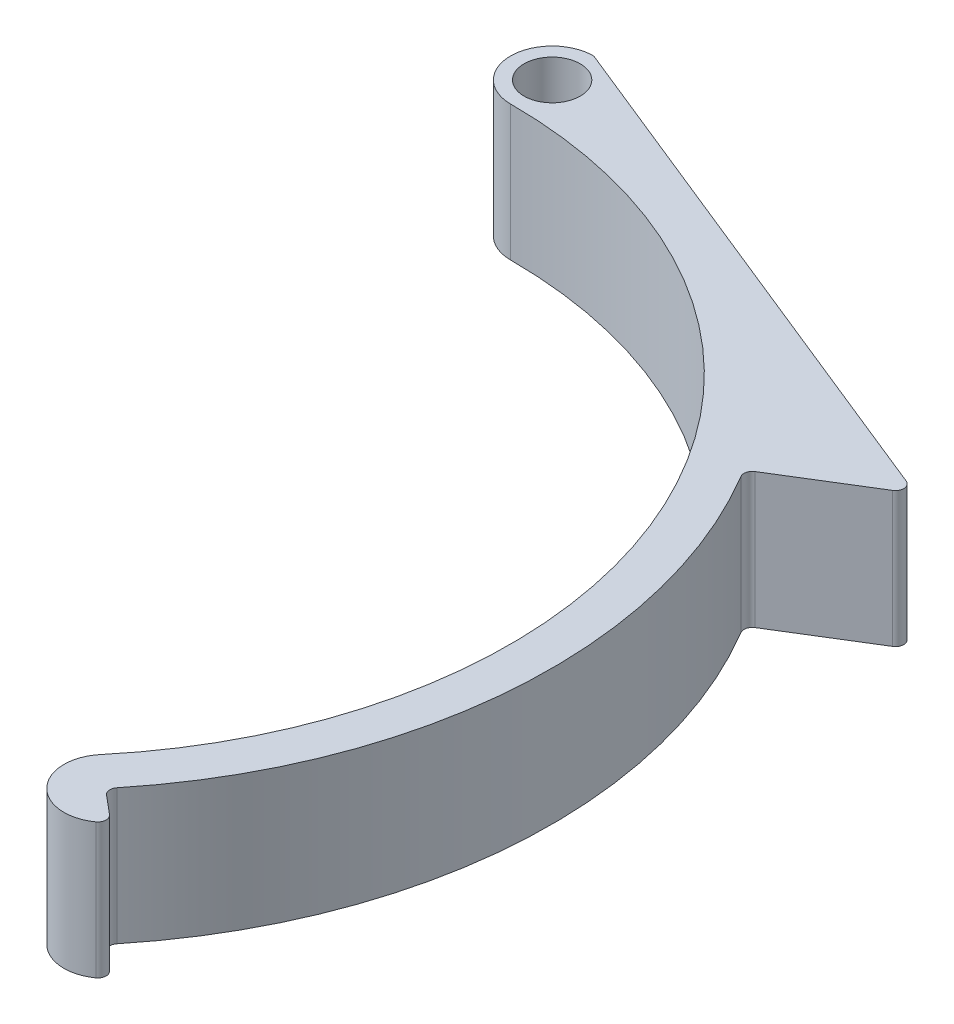
ISO-10303-21;
HEADER;
FILE_DESCRIPTION(('STEP AP214'),'2;1');
FILE_NAME('part.step','',(''),(''),'','','');
FILE_SCHEMA(('AUTOMOTIVE_DESIGN { 1 0 10303 214 1 1 1 1 }'));
ENDSEC;
DATA;
#1=APPLICATION_CONTEXT('core data for automotive mechanical design processes');
#2=APPLICATION_PROTOCOL_DEFINITION('international standard','automotive_design',2000,#1);
#3=PRODUCT_CONTEXT('',#1,'mechanical');
#4=PRODUCT('Part','Part','',(#3));
#5=PRODUCT_RELATED_PRODUCT_CATEGORY('part','',(#4));
#6=PRODUCT_DEFINITION_FORMATION('','',#4);
#7=PRODUCT_DEFINITION_CONTEXT('part definition',#1,'design');
#8=PRODUCT_DEFINITION('design','',#6,#7);
#9=PRODUCT_DEFINITION_SHAPE('','',#8);
#10=(LENGTH_UNIT() NAMED_UNIT(*) SI_UNIT(.MILLI.,.METRE.));
#11=(NAMED_UNIT(*) PLANE_ANGLE_UNIT() SI_UNIT($,.RADIAN.));
#12=(NAMED_UNIT(*) SI_UNIT($,.STERADIAN.) SOLID_ANGLE_UNIT());
#13=UNCERTAINTY_MEASURE_WITH_UNIT(LENGTH_MEASURE(1.E-05),#10,'distance_accuracy_value','');
#14=(GEOMETRIC_REPRESENTATION_CONTEXT(3) GLOBAL_UNCERTAINTY_ASSIGNED_CONTEXT((#13)) GLOBAL_UNIT_ASSIGNED_CONTEXT((#10,
#11,#12)) REPRESENTATION_CONTEXT('',''));
#15=CARTESIAN_POINT('',(0.,0.,0.));
#16=DIRECTION('',(0.,0.,1.));
#17=DIRECTION('',(1.,0.,0.));
#18=AXIS2_PLACEMENT_3D('',#15,#16,#17);
#19=CARTESIAN_POINT('',(18.4107690922549,13.,-45.5602618405853));
#20=DIRECTION('',(0.374663072776281,0.,-0.927161033422908));
#21=DIRECTION('',(-0.927161033422908,0.,-0.374663072776281));
#22=AXIS2_PLACEMENT_3D('',#19,#20,#21);
#23=PLANE('',#22);
#24=DIRECTION('',(0.927161033422908,0.,0.374663072776281));
#25=VECTOR('',#24,1.);
#26=CARTESIAN_POINT('',(18.4107690922549,0.,-45.5602618405853));
#27=LINE('',#26,#25);
#28=CARTESIAN_POINT('',(0.152578115339287,0.,-52.938343628053));
#29=VERTEX_POINT('',#28);
#30=CARTESIAN_POINT('',(50.4547105940548,0.,-32.6113984240491));
#31=VERTEX_POINT('',#30);
#32=EDGE_CURVE('E189',#29,#31,#27,.T.);
#33=ORIENTED_EDGE('',*,*,#32,.F.);
#34=DIRECTION('',(0.,-1.,0.));
#35=VECTOR('',#34,1.);
#36=CARTESIAN_POINT('',(0.152578115339284,13.,-52.938343628053));
#37=LINE('',#36,#35);
#38=CARTESIAN_POINT('',(0.152578115339287,13.,-52.938343628053));
#39=VERTEX_POINT('',#38);
#40=EDGE_CURVE('E231',#29,#39,#37,.F.);
#41=ORIENTED_EDGE('',*,*,#40,.T.);
#42=DIRECTION('',(0.927161033422908,0.,0.374663072776281));
#43=VECTOR('',#42,1.);
#44=CARTESIAN_POINT('',(18.4107690922549,13.,-45.5602618405853));
#45=LINE('',#44,#43);
#46=CARTESIAN_POINT('',(50.4547105940548,13.,-32.6113984240491));
#47=VERTEX_POINT('',#46);
#48=EDGE_CURVE('E165',#39,#47,#45,.T.);
#49=ORIENTED_EDGE('',*,*,#48,.T.);
#50=DIRECTION('',(0.,-1.,0.));
#51=VECTOR('',#50,1.);
#52=CARTESIAN_POINT('',(50.4547105940548,13.,-32.6113984240491));
#53=LINE('',#52,#51);
#54=EDGE_CURVE('E227',#47,#31,#53,.T.);
#55=ORIENTED_EDGE('',*,*,#54,.T.);
#56=EDGE_LOOP('',(#33,#41,#49,#55));
#57=FACE_BOUND('',#56,.T.);
#58=ADVANCED_FACE('F45',(#57),#23,.T.);
#59=CARTESIAN_POINT('',(0.,13.,-49.));
#60=DIRECTION('',(0.,-1.,0.));
#61=DIRECTION('',(0.,0.,-1.));
#62=AXIS2_PLACEMENT_3D('',#59,#60,#61);
#63=CYLINDRICAL_SURFACE('',#62,4.);
#64=CARTESIAN_POINT('',(0.,13.,-49.));
#65=DIRECTION('',(0.,1.,0.));
#66=DIRECTION('',(0.,0.,1.));
#67=AXIS2_PLACEMENT_3D('',#64,#65,#66);
#68=CIRCLE('',#67,4.);
#69=CARTESIAN_POINT('',(0.,13.,-45.));
#70=VERTEX_POINT('',#69);
#71=CARTESIAN_POINT('',(-0.183940428602176,13.,-52.9957685016434));
#72=VERTEX_POINT('',#71);
#73=EDGE_CURVE('E140',#70,#72,#68,.F.);
#74=ORIENTED_EDGE('',*,*,#73,.T.);
#75=DIRECTION('',(0.,-1.,0.));
#76=VECTOR('',#75,1.);
#77=CARTESIAN_POINT('',(-0.183940428602176,13.,-52.9957685016434));
#78=LINE('',#77,#76);
#79=CARTESIAN_POINT('',(-0.183940428602176,0.,-52.9957685016434));
#80=VERTEX_POINT('',#79);
#81=EDGE_CURVE('E148',#72,#80,#78,.T.);
#82=ORIENTED_EDGE('',*,*,#81,.T.);
#83=CARTESIAN_POINT('',(0.,0.,-49.));
#84=DIRECTION('',(0.,1.,0.));
#85=DIRECTION('',(0.,0.,1.));
#86=AXIS2_PLACEMENT_3D('',#83,#84,#85);
#87=CIRCLE('',#86,4.);
#88=CARTESIAN_POINT('',(0.,0.,-45.));
#89=VERTEX_POINT('',#88);
#90=EDGE_CURVE('E143',#89,#80,#87,.F.);
#91=ORIENTED_EDGE('',*,*,#90,.F.);
#92=DIRECTION('',(0.,-1.,0.));
#93=VECTOR('',#92,1.);
#94=CARTESIAN_POINT('',(0.,13.,-45.));
#95=LINE('',#94,#93);
#96=EDGE_CURVE('E135',#70,#89,#95,.T.);
#97=ORIENTED_EDGE('',*,*,#96,.F.);
#98=EDGE_LOOP('',(#74,#82,#91,#97));
#99=FACE_BOUND('',#98,.T.);
#100=ADVANCED_FACE('F137',(#99),#63,.T.);
#101=CARTESIAN_POINT('',(0.,13.,0.));
#102=DIRECTION('',(0.,-1.,0.));
#103=DIRECTION('',(0.,0.,-1.));
#104=AXIS2_PLACEMENT_3D('',#101,#102,#103);
#105=CYLINDRICAL_SURFACE('',#104,45.);
#106=CARTESIAN_POINT('',(0.,0.,0.));
#107=DIRECTION('',(0.,1.,0.));
#108=DIRECTION('',(0.,0.,1.));
#109=AXIS2_PLACEMENT_3D('',#106,#107,#108);
#110=CIRCLE('',#109,45.);
#111=CARTESIAN_POINT('',(34.4719999403541,0.,28.9254424358942));
#112=VERTEX_POINT('',#111);
#113=EDGE_CURVE('E195',#89,#112,#110,.F.);
#114=ORIENTED_EDGE('',*,*,#113,.T.);
#115=DIRECTION('',(0.,-1.,0.));
#116=VECTOR('',#115,1.);
#117=CARTESIAN_POINT('',(34.4719999403541,13.,28.9254424358942));
#118=LINE('',#117,#116);
#119=CARTESIAN_POINT('',(34.4719999403541,13.,28.9254424358942));
#120=VERTEX_POINT('',#119);
#121=EDGE_CURVE('E149',#120,#112,#118,.T.);
#122=ORIENTED_EDGE('',*,*,#121,.F.);
#123=CARTESIAN_POINT('',(0.,13.,0.));
#124=DIRECTION('',(0.,1.,0.));
#125=DIRECTION('',(0.,0.,1.));
#126=AXIS2_PLACEMENT_3D('',#123,#124,#125);
#127=CIRCLE('',#126,45.);
#128=EDGE_CURVE('E153',#70,#120,#127,.F.);
#129=ORIENTED_EDGE('',*,*,#128,.F.);
#130=ORIENTED_EDGE('',*,*,#96,.T.);
#131=EDGE_LOOP('',(#114,#122,#129,#130));
#132=FACE_BOUND('',#131,.T.);
#133=ADVANCED_FACE('F154',(#132),#105,.F.);
#134=CARTESIAN_POINT('',(37.53617771283,13.,31.4965928746403));
#135=DIRECTION('',(0.,-1.,0.));
#136=DIRECTION('',(0.,0.,-1.));
#137=AXIS2_PLACEMENT_3D('',#134,#135,#136);
#138=CYLINDRICAL_SURFACE('',#137,4.);
#139=CARTESIAN_POINT('',(37.53617771283,0.,31.4965928746403));
#140=DIRECTION('',(0.,1.,0.));
#141=DIRECTION('',(0.,0.,1.));
#142=AXIS2_PLACEMENT_3D('',#139,#140,#141);
#143=CIRCLE('',#142,4.);
#144=CARTESIAN_POINT('',(39.860267473798,0.,34.7521430252238));
#145=VERTEX_POINT('',#144);
#146=EDGE_CURVE('E198',#112,#145,#143,.T.);
#147=ORIENTED_EDGE('',*,*,#146,.T.);
#148=DIRECTION('',(0.,-1.,0.));
#149=VECTOR('',#148,1.);
#150=CARTESIAN_POINT('',(39.860267473798,13.,34.7521430252238));
#151=LINE('',#150,#149);
#152=CARTESIAN_POINT('',(39.860267473798,13.,34.7521430252238));
#153=VERTEX_POINT('',#152);
#154=EDGE_CURVE('E256',#145,#153,#151,.F.);
#155=ORIENTED_EDGE('',*,*,#154,.T.);
#156=CARTESIAN_POINT('',(37.53617771283,13.,31.4965928746403));
#157=DIRECTION('',(0.,1.,0.));
#158=DIRECTION('',(0.,0.,1.));
#159=AXIS2_PLACEMENT_3D('',#156,#157,#158);
#160=CIRCLE('',#159,4.);
#161=EDGE_CURVE('E158',#120,#153,#160,.T.);
#162=ORIENTED_EDGE('',*,*,#161,.F.);
#163=ORIENTED_EDGE('',*,*,#121,.T.);
#164=EDGE_LOOP('',(#147,#155,#162,#163));
#165=FACE_BOUND('',#164,.T.);
#166=ADVANCED_FACE('F334',(#165),#138,.T.);
#167=CARTESIAN_POINT('',(0.,13.,0.));
#168=DIRECTION('',(0.642787609686538,0.,-0.766044443118979));
#169=DIRECTION('',(-0.766044443118979,0.,-0.642787609686538));
#170=AXIS2_PLACEMENT_3D('',#167,#168,#169);
#171=PLANE('',#170);
#172=DIRECTION('',(0.766044443118979,0.,0.642787609686538));
#173=VECTOR('',#172,1.);
#174=CARTESIAN_POINT('',(0.,0.,0.));
#175=LINE('',#174,#173);
#176=CARTESIAN_POINT('',(38.1440905757851,0.,32.0066923337339));
#177=VERTEX_POINT('',#176);
#178=CARTESIAN_POINT('',(39.9096796093536,0.,33.4881974406119));
#179=VERTEX_POINT('',#178);
#180=EDGE_CURVE('E202',#177,#179,#175,.T.);
#181=ORIENTED_EDGE('',*,*,#180,.F.);
#182=DIRECTION('',(0.,-1.,0.));
#183=VECTOR('',#182,1.);
#184=CARTESIAN_POINT('',(38.1440905757851,13.,32.0066923337339));
#185=LINE('',#184,#183);
#186=CARTESIAN_POINT('',(38.1440905757851,13.,32.0066923337339));
#187=VERTEX_POINT('',#186);
#188=EDGE_CURVE('E253',#177,#187,#185,.F.);
#189=ORIENTED_EDGE('',*,*,#188,.T.);
#190=DIRECTION('',(0.766044443118979,0.,0.642787609686538));
#191=VECTOR('',#190,1.);
#192=CARTESIAN_POINT('',(0.,13.,0.));
#193=LINE('',#192,#191);
#194=CARTESIAN_POINT('',(39.9096796093536,13.,33.4881974406119));
#195=VERTEX_POINT('',#194);
#196=EDGE_CURVE('E175',#187,#195,#193,.T.);
#197=ORIENTED_EDGE('',*,*,#196,.T.);
#198=DIRECTION('',(0.,1.,0.));
#199=VECTOR('',#198,1.);
#200=CARTESIAN_POINT('',(39.9096796093536,0.,33.4881974406119));
#201=LINE('',#200,#199);
#202=EDGE_CURVE('E249',#195,#179,#201,.F.);
#203=ORIENTED_EDGE('',*,*,#202,.T.);
#204=EDGE_LOOP('',(#181,#189,#197,#203));
#205=FACE_BOUND('',#204,.T.);
#206=ADVANCED_FACE('F319',(#205),#171,.T.);
#207=CARTESIAN_POINT('',(0.,13.,0.));
#208=DIRECTION('',(0.,-1.,0.));
#209=DIRECTION('',(0.,0.,-1.));
#210=AXIS2_PLACEMENT_3D('',#207,#208,#209);
#211=CYLINDRICAL_SURFACE('',#210,49.);
#212=CARTESIAN_POINT('',(0.,13.,0.));
#213=DIRECTION('',(0.,1.,0.));
#214=DIRECTION('',(0.,0.,1.));
#215=AXIS2_PLACEMENT_3D('',#212,#213,#214);
#216=CIRCLE('',#215,49.);
#217=CARTESIAN_POINT('',(38.0373034641201,13.,30.8895377948333));
#218=VERTEX_POINT('',#217);
#219=CARTESIAN_POINT('',(42.1148392112088,13.,-25.0467626294103));
#220=VERTEX_POINT('',#219);
#221=EDGE_CURVE('E179',#218,#220,#216,.T.);
#222=ORIENTED_EDGE('',*,*,#221,.F.);
#223=DIRECTION('',(0.,-1.,0.));
#224=VECTOR('',#223,1.);
#225=CARTESIAN_POINT('',(38.0373034641201,13.,30.8895377948333));
#226=LINE('',#225,#224);
#227=CARTESIAN_POINT('',(38.0373034641201,0.,30.8895377948333));
#228=VERTEX_POINT('',#227);
#229=EDGE_CURVE('E245',#218,#228,#226,.T.);
#230=ORIENTED_EDGE('',*,*,#229,.T.);
#231=CARTESIAN_POINT('',(0.,0.,0.));
#232=DIRECTION('',(0.,1.,0.));
#233=DIRECTION('',(0.,0.,1.));
#234=AXIS2_PLACEMENT_3D('',#231,#232,#233);
#235=CIRCLE('',#234,49.);
#236=CARTESIAN_POINT('',(42.1148392112088,0.,-25.0467626294103));
#237=VERTEX_POINT('',#236);
#238=EDGE_CURVE('E206',#228,#237,#235,.T.);
#239=ORIENTED_EDGE('',*,*,#238,.T.);
#240=DIRECTION('',(0.,-1.,0.));
#241=VECTOR('',#240,1.);
#242=CARTESIAN_POINT('',(42.1148392112088,13.,-25.0467626294103));
#243=LINE('',#242,#241);
#244=EDGE_CURVE('E242',#237,#220,#243,.F.);
#245=ORIENTED_EDGE('',*,*,#244,.T.);
#246=EDGE_LOOP('',(#222,#230,#239,#245));
#247=FACE_BOUND('',#246,.T.);
#248=ADVANCED_FACE('F279',(#247),#211,.T.);
#249=CARTESIAN_POINT('',(0.,13.,-49.));
#250=DIRECTION('',(0.,-1.,0.));
#251=DIRECTION('',(0.,0.,-1.));
#252=AXIS2_PLACEMENT_3D('',#249,#250,#251);
#253=CYLINDRICAL_SURFACE('',#252,2.7);
#254=CARTESIAN_POINT('',(0.,13.,-49.));
#255=DIRECTION('',(0.,1.,0.));
#256=DIRECTION('',(0.,0.,1.));
#257=AXIS2_PLACEMENT_3D('',#254,#255,#256);
#258=CIRCLE('',#257,2.7);
#259=CARTESIAN_POINT('',(0.,13.,-46.3));
#260=VERTEX_POINT('',#259);
#261=EDGE_CURVE('E169',#260,#260,#258,.T.);
#262=ORIENTED_EDGE('',*,*,#261,.T.);
#263=EDGE_LOOP('',(#262));
#264=FACE_BOUND('',#263,.T.);
#265=CARTESIAN_POINT('',(0.,0.,-49.));
#266=DIRECTION('',(0.,1.,0.));
#267=DIRECTION('',(0.,0.,1.));
#268=AXIS2_PLACEMENT_3D('',#265,#266,#267);
#269=CIRCLE('',#268,2.7);
#270=CARTESIAN_POINT('',(0.,0.,-46.3));
#271=VERTEX_POINT('',#270);
#272=EDGE_CURVE('E185',#271,#271,#269,.T.);
#273=ORIENTED_EDGE('',*,*,#272,.F.);
#274=EDGE_LOOP('',(#273));
#275=FACE_BOUND('',#274,.T.);
#276=ADVANCED_FACE('F311',(#264,#275),#253,.F.);
#277=CARTESIAN_POINT('',(0.,13.,0.));
#278=DIRECTION('',(0.524899474172595,0.,0.851164227404637));
#279=DIRECTION('',(0.851164227404637,0.,-0.524899474172595));
#280=AXIS2_PLACEMENT_3D('',#277,#278,#279);
#281=PLANE('',#280);
#282=DIRECTION('',(-0.851164227404637,0.,0.524899474172595));
#283=VECTOR('',#282,1.);
#284=CARTESIAN_POINT('',(0.,0.,0.));
#285=LINE('',#284,#283);
#286=CARTESIAN_POINT('',(50.5748997151719,0.,-31.1887382153871));
#287=VERTEX_POINT('',#286);
#288=CARTESIAN_POINT('',(42.3825088434823,0.,-26.1366207481407));
#289=VERTEX_POINT('',#288);
#290=EDGE_CURVE('E210',#287,#289,#285,.T.);
#291=ORIENTED_EDGE('',*,*,#290,.F.);
#292=DIRECTION('',(0.,-1.,0.));
#293=VECTOR('',#292,1.);
#294=CARTESIAN_POINT('',(50.5748997151719,13.,-31.1887382153871));
#295=LINE('',#294,#293);
#296=CARTESIAN_POINT('',(50.5748997151719,13.,-31.1887382153871));
#297=VERTEX_POINT('',#296);
#298=EDGE_CURVE('E66',#287,#297,#295,.F.);
#299=ORIENTED_EDGE('',*,*,#298,.T.);
#300=DIRECTION('',(-0.851164227404637,0.,0.524899474172595));
#301=VECTOR('',#300,1.);
#302=CARTESIAN_POINT('',(0.,13.,0.));
#303=LINE('',#302,#301);
#304=CARTESIAN_POINT('',(42.3825088434823,13.,-26.1366207481407));
#305=VERTEX_POINT('',#304);
#306=EDGE_CURVE('E182',#297,#305,#303,.T.);
#307=ORIENTED_EDGE('',*,*,#306,.T.);
#308=DIRECTION('',(0.,-1.,0.));
#309=VECTOR('',#308,1.);
#310=CARTESIAN_POINT('',(42.3825088434823,13.,-26.1366207481407));
#311=LINE('',#310,#309);
#312=EDGE_CURVE('E259',#305,#289,#311,.T.);
#313=ORIENTED_EDGE('',*,*,#312,.T.);
#314=EDGE_LOOP('',(#291,#299,#307,#313));
#315=FACE_BOUND('',#314,.T.);
#316=ADVANCED_FACE('F281',(#315),#281,.T.);
#317=CARTESIAN_POINT('',(0.,13.,0.));
#318=DIRECTION('',(0.,1.,0.));
#319=DIRECTION('',(0.,0.,1.));
#320=AXIS2_PLACEMENT_3D('',#317,#318,#319);
#321=PLANE('',#320);
#322=ORIENTED_EDGE('',*,*,#261,.F.);
#323=EDGE_LOOP('',(#322));
#324=FACE_BOUND('',#323,.T.);
#325=ORIENTED_EDGE('',*,*,#48,.F.);
#326=CARTESIAN_POINT('',(-0.147152342881741,13.,-52.1966148013147));
#327=DIRECTION('',(0.,1.,0.));
#328=DIRECTION('',(0.,0.,1.));
#329=AXIS2_PLACEMENT_3D('',#326,#327,#328);
#330=CIRCLE('',#329,0.8);
#331=EDGE_CURVE('E163',#39,#72,#330,.T.);
#332=ORIENTED_EDGE('',*,*,#331,.T.);
#333=ORIENTED_EDGE('',*,*,#73,.F.);
#334=ORIENTED_EDGE('',*,*,#128,.T.);
#335=ORIENTED_EDGE('',*,*,#161,.T.);
#336=CARTESIAN_POINT('',(39.3954495216044,13.,34.1010329951071));
#337=DIRECTION('',(0.,1.,0.));
#338=DIRECTION('',(0.,0.,1.));
#339=AXIS2_PLACEMENT_3D('',#336,#337,#338);
#340=CIRCLE('',#339,0.8);
#341=EDGE_CURVE('E237',#153,#195,#340,.T.);
#342=ORIENTED_EDGE('',*,*,#341,.T.);
#343=ORIENTED_EDGE('',*,*,#196,.F.);
#344=CARTESIAN_POINT('',(38.6583206635343,13.,31.3938567792387));
#345=DIRECTION('',(0.,1.,0.));
#346=DIRECTION('',(0.,0.,1.));
#347=AXIS2_PLACEMENT_3D('',#344,#345,#346);
#348=CIRCLE('',#347,0.8);
#349=EDGE_CURVE('E268',#187,#218,#348,.F.);
#350=ORIENTED_EDGE('',*,*,#349,.T.);
#351=ORIENTED_EDGE('',*,*,#221,.T.);
#352=CARTESIAN_POINT('',(42.8024284228204,13.,-25.455689366217));
#353=DIRECTION('',(0.,1.,0.));
#354=DIRECTION('',(0.,0.,1.));
#355=AXIS2_PLACEMENT_3D('',#352,#353,#354);
#356=CIRCLE('',#355,0.8);
#357=EDGE_CURVE('E11',#220,#305,#356,.F.);
#358=ORIENTED_EDGE('',*,*,#357,.T.);
#359=ORIENTED_EDGE('',*,*,#306,.F.);
#360=CARTESIAN_POINT('',(50.1549801358338,13.,-31.8696695973108));
#361=DIRECTION('',(0.,1.,0.));
#362=DIRECTION('',(0.,0.,1.));
#363=AXIS2_PLACEMENT_3D('',#360,#361,#362);
#364=CIRCLE('',#363,0.8);
#365=EDGE_CURVE('E234',#297,#47,#364,.T.);
#366=ORIENTED_EDGE('',*,*,#365,.T.);
#367=EDGE_LOOP('',(#325,#332,#333,#334,#335,#342,#343,#350,#351,#358,#359,#366));
#368=FACE_BOUND('',#367,.T.);
#369=ADVANCED_FACE('F161',(#324,#368),#321,.T.);
#370=CARTESIAN_POINT('',(0.,0.,0.));
#371=DIRECTION('',(0.,1.,0.));
#372=DIRECTION('',(0.,0.,1.));
#373=AXIS2_PLACEMENT_3D('',#370,#371,#372);
#374=PLANE('',#373);
#375=ORIENTED_EDGE('',*,*,#272,.T.);
#376=EDGE_LOOP('',(#375));
#377=FACE_BOUND('',#376,.T.);
#378=ORIENTED_EDGE('',*,*,#90,.T.);
#379=CARTESIAN_POINT('',(-0.147152342881741,0.,-52.1966148013147));
#380=DIRECTION('',(0.,1.,0.));
#381=DIRECTION('',(0.,0.,1.));
#382=AXIS2_PLACEMENT_3D('',#379,#380,#381);
#383=CIRCLE('',#382,0.8);
#384=EDGE_CURVE('E224',#80,#29,#383,.F.);
#385=ORIENTED_EDGE('',*,*,#384,.T.);
#386=ORIENTED_EDGE('',*,*,#32,.T.);
#387=CARTESIAN_POINT('',(50.1549801358338,0.,-31.8696695973108));
#388=DIRECTION('',(0.,1.,0.));
#389=DIRECTION('',(0.,0.,1.));
#390=AXIS2_PLACEMENT_3D('',#387,#388,#389);
#391=CIRCLE('',#390,0.8);
#392=EDGE_CURVE('E218',#31,#287,#391,.F.);
#393=ORIENTED_EDGE('',*,*,#392,.T.);
#394=ORIENTED_EDGE('',*,*,#290,.T.);
#395=CARTESIAN_POINT('',(42.8024284228204,0.,-25.455689366217));
#396=DIRECTION('',(0.,1.,0.));
#397=DIRECTION('',(0.,0.,1.));
#398=AXIS2_PLACEMENT_3D('',#395,#396,#397);
#399=CIRCLE('',#398,0.8);
#400=EDGE_CURVE('E54',#289,#237,#399,.T.);
#401=ORIENTED_EDGE('',*,*,#400,.T.);
#402=ORIENTED_EDGE('',*,*,#238,.F.);
#403=CARTESIAN_POINT('',(38.6583206635343,0.,31.3938567792387));
#404=DIRECTION('',(0.,1.,0.));
#405=DIRECTION('',(0.,0.,1.));
#406=AXIS2_PLACEMENT_3D('',#403,#404,#405);
#407=CIRCLE('',#406,0.8);
#408=EDGE_CURVE('E265',#228,#177,#407,.T.);
#409=ORIENTED_EDGE('',*,*,#408,.T.);
#410=ORIENTED_EDGE('',*,*,#180,.T.);
#411=CARTESIAN_POINT('',(39.3954495216044,0.,34.1010329951071));
#412=DIRECTION('',(0.,1.,0.));
#413=DIRECTION('',(0.,0.,1.));
#414=AXIS2_PLACEMENT_3D('',#411,#412,#413);
#415=CIRCLE('',#414,0.8);
#416=EDGE_CURVE('E221',#179,#145,#415,.F.);
#417=ORIENTED_EDGE('',*,*,#416,.T.);
#418=ORIENTED_EDGE('',*,*,#146,.F.);
#419=ORIENTED_EDGE('',*,*,#113,.F.);
#420=EDGE_LOOP('',(#378,#385,#386,#393,#394,#401,#402,#409,#410,#417,#418,#419));
#421=FACE_BOUND('',#420,.T.);
#422=ADVANCED_FACE('F273',(#377,#421),#374,.F.);
#423=CARTESIAN_POINT('',(-0.147152342881741,13.,-52.1966148013147));
#424=DIRECTION('',(0.,-1.,0.));
#425=DIRECTION('',(0.,0.,-1.));
#426=AXIS2_PLACEMENT_3D('',#423,#424,#425);
#427=CYLINDRICAL_SURFACE('',#426,0.8);
#428=ORIENTED_EDGE('',*,*,#331,.F.);
#429=ORIENTED_EDGE('',*,*,#40,.F.);
#430=ORIENTED_EDGE('',*,*,#384,.F.);
#431=ORIENTED_EDGE('',*,*,#81,.F.);
#432=EDGE_LOOP('',(#428,#429,#430,#431));
#433=FACE_BOUND('',#432,.T.);
#434=ADVANCED_FACE('F290',(#433),#427,.T.);
#435=CARTESIAN_POINT('',(38.6583206635343,13.,31.3938567792387));
#436=DIRECTION('',(0.,-1.,0.));
#437=DIRECTION('',(0.,0.,-1.));
#438=AXIS2_PLACEMENT_3D('',#435,#436,#437);
#439=CYLINDRICAL_SURFACE('',#438,0.8);
#440=ORIENTED_EDGE('',*,*,#349,.F.);
#441=ORIENTED_EDGE('',*,*,#188,.F.);
#442=ORIENTED_EDGE('',*,*,#408,.F.);
#443=ORIENTED_EDGE('',*,*,#229,.F.);
#444=EDGE_LOOP('',(#440,#441,#442,#443));
#445=FACE_BOUND('',#444,.T.);
#446=ADVANCED_FACE('F292',(#445),#439,.F.);
#447=CARTESIAN_POINT('',(39.3954495216044,13.,34.1010329951071));
#448=DIRECTION('',(0.,-1.,0.));
#449=DIRECTION('',(0.,0.,-1.));
#450=AXIS2_PLACEMENT_3D('',#447,#448,#449);
#451=CYLINDRICAL_SURFACE('',#450,0.8);
#452=ORIENTED_EDGE('',*,*,#341,.F.);
#453=ORIENTED_EDGE('',*,*,#154,.F.);
#454=ORIENTED_EDGE('',*,*,#416,.F.);
#455=ORIENTED_EDGE('',*,*,#202,.F.);
#456=EDGE_LOOP('',(#452,#453,#454,#455));
#457=FACE_BOUND('',#456,.T.);
#458=ADVANCED_FACE('F298',(#457),#451,.T.);
#459=CARTESIAN_POINT('',(50.1549801358338,13.,-31.8696695973108));
#460=DIRECTION('',(0.,-1.,0.));
#461=DIRECTION('',(0.,0.,-1.));
#462=AXIS2_PLACEMENT_3D('',#459,#460,#461);
#463=CYLINDRICAL_SURFACE('',#462,0.8);
#464=ORIENTED_EDGE('',*,*,#365,.F.);
#465=ORIENTED_EDGE('',*,*,#298,.F.);
#466=ORIENTED_EDGE('',*,*,#392,.F.);
#467=ORIENTED_EDGE('',*,*,#54,.F.);
#468=EDGE_LOOP('',(#464,#465,#466,#467));
#469=FACE_BOUND('',#468,.T.);
#470=ADVANCED_FACE('F285',(#469),#463,.T.);
#471=CARTESIAN_POINT('',(42.8024284228204,13.,-25.455689366217));
#472=DIRECTION('',(0.,-1.,0.));
#473=DIRECTION('',(0.,0.,-1.));
#474=AXIS2_PLACEMENT_3D('',#471,#472,#473);
#475=CYLINDRICAL_SURFACE('',#474,0.8);
#476=ORIENTED_EDGE('',*,*,#357,.F.);
#477=ORIENTED_EDGE('',*,*,#244,.F.);
#478=ORIENTED_EDGE('',*,*,#400,.F.);
#479=ORIENTED_EDGE('',*,*,#312,.F.);
#480=EDGE_LOOP('',(#476,#477,#478,#479));
#481=FACE_BOUND('',#480,.T.);
#482=ADVANCED_FACE('F47',(#481),#475,.F.);
#483=CLOSED_SHELL('',(#58,#100,#133,#166,#206,#248,#276,#316,#369,#422,#434,#446,#458,#470,#482));
#484=MANIFOLD_SOLID_BREP('B2',#483);
#485=ADVANCED_BREP_SHAPE_REPRESENTATION('',(#18,#484),#14);
#486=SHAPE_DEFINITION_REPRESENTATION(#9,#485);
ENDSEC;
END-ISO-10303-21;
